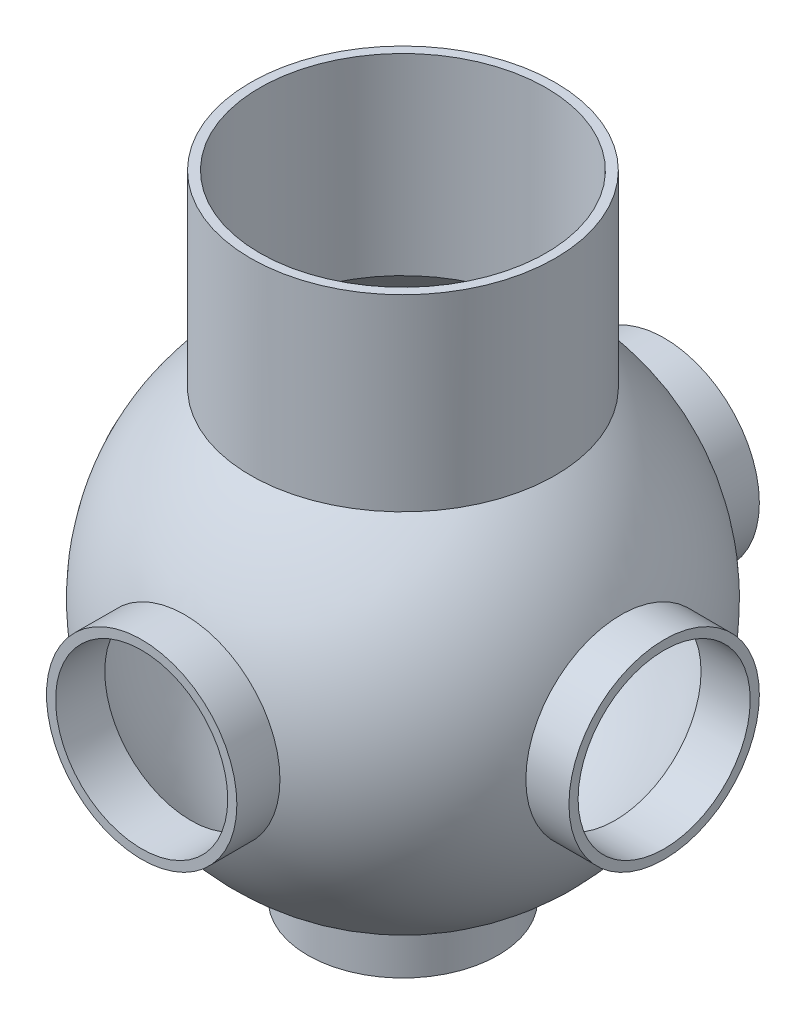
ISO-10303-21;
HEADER;
FILE_DESCRIPTION(('STEP AP214'),'2;1');
FILE_NAME('part.step','',(''),(''),'','','');
FILE_SCHEMA(('AUTOMOTIVE_DESIGN { 1 0 10303 214 1 1 1 1 }'));
ENDSEC;
DATA;
#1=APPLICATION_CONTEXT('core data for automotive mechanical design processes');
#2=APPLICATION_PROTOCOL_DEFINITION('international standard','automotive_design',2000,#1);
#3=PRODUCT_CONTEXT('',#1,'mechanical');
#4=PRODUCT('Part','Part','',(#3));
#5=PRODUCT_RELATED_PRODUCT_CATEGORY('part','',(#4));
#6=PRODUCT_DEFINITION_FORMATION('','',#4);
#7=PRODUCT_DEFINITION_CONTEXT('part definition',#1,'design');
#8=PRODUCT_DEFINITION('design','',#6,#7);
#9=PRODUCT_DEFINITION_SHAPE('','',#8);
#10=(LENGTH_UNIT() NAMED_UNIT(*) SI_UNIT(.MILLI.,.METRE.));
#11=(NAMED_UNIT(*) PLANE_ANGLE_UNIT() SI_UNIT($,.RADIAN.));
#12=(NAMED_UNIT(*) SI_UNIT($,.STERADIAN.) SOLID_ANGLE_UNIT());
#13=UNCERTAINTY_MEASURE_WITH_UNIT(LENGTH_MEASURE(1.E-05),#10,'distance_accuracy_value','');
#14=(GEOMETRIC_REPRESENTATION_CONTEXT(3) GLOBAL_UNCERTAINTY_ASSIGNED_CONTEXT((#13)) GLOBAL_UNIT_ASSIGNED_CONTEXT((#10,
#11,#12)) REPRESENTATION_CONTEXT('',''));
#15=CARTESIAN_POINT('',(0.,0.,0.));
#16=DIRECTION('',(0.,0.,1.));
#17=DIRECTION('',(1.,0.,0.));
#18=AXIS2_PLACEMENT_3D('',#15,#16,#17);
#19=CARTESIAN_POINT('',(0.,123.698,0.));
#20=DIRECTION('',(0.,-1.,0.));
#21=DIRECTION('',(0.,0.,-1.));
#22=AXIS2_PLACEMENT_3D('',#19,#20,#21);
#23=CYLINDRICAL_SURFACE('',#22,47.752);
#24=CARTESIAN_POINT('',(0.,123.698,0.));
#25=DIRECTION('',(0.,1.,0.));
#26=DIRECTION('',(0.,0.,1.));
#27=AXIS2_PLACEMENT_3D('',#24,#25,#26);
#28=CIRCLE('',#27,47.752);
#29=CARTESIAN_POINT('',(0.,123.698,47.752));
#30=VERTEX_POINT('',#29);
#31=EDGE_CURVE('E68',#30,#30,#28,.T.);
#32=ORIENTED_EDGE('',*,*,#31,.T.);
#33=EDGE_LOOP('',(#32));
#34=FACE_BOUND('',#33,.T.);
#35=CARTESIAN_POINT('',(0.,59.5445835068144,0.));
#36=DIRECTION('',(0.,-1.,0.));
#37=DIRECTION('',(0.,0.,-1.));
#38=AXIS2_PLACEMENT_3D('',#35,#36,#37);
#39=CIRCLE('',#38,47.752);
#40=CARTESIAN_POINT('',(0.,59.5445835068144,-47.752));
#41=VERTEX_POINT('',#40);
#42=EDGE_CURVE('E144',#41,#41,#39,.T.);
#43=ORIENTED_EDGE('',*,*,#42,.T.);
#44=EDGE_LOOP('',(#43));
#45=FACE_BOUND('',#44,.T.);
#46=ADVANCED_FACE('F30',(#34,#45),#23,.F.);
#47=CARTESIAN_POINT('',(0.,-87.122,0.));
#48=DIRECTION('',(0.,1.,0.));
#49=DIRECTION('',(0.,0.,1.));
#50=AXIS2_PLACEMENT_3D('',#47,#48,#49);
#51=CYLINDRICAL_SURFACE('',#50,28.702);
#52=CARTESIAN_POINT('',(0.,-87.122,0.));
#53=DIRECTION('',(0.,1.,0.));
#54=DIRECTION('',(0.,0.,1.));
#55=AXIS2_PLACEMENT_3D('',#52,#53,#54);
#56=CIRCLE('',#55,28.702);
#57=CARTESIAN_POINT('',(0.,-87.122,28.702));
#58=VERTEX_POINT('',#57);
#59=EDGE_CURVE('E75',#58,#58,#56,.T.);
#60=ORIENTED_EDGE('',*,*,#59,.F.);
#61=EDGE_LOOP('',(#60));
#62=FACE_BOUND('',#61,.T.);
#63=CARTESIAN_POINT('',(0.,-70.7248621419653,0.));
#64=DIRECTION('',(0.,1.,0.));
#65=DIRECTION('',(0.,0.,1.));
#66=AXIS2_PLACEMENT_3D('',#63,#64,#65);
#67=CIRCLE('',#66,28.702);
#68=CARTESIAN_POINT('',(0.,-70.7248621419653,28.702));
#69=VERTEX_POINT('',#68);
#70=EDGE_CURVE('E162',#69,#69,#67,.F.);
#71=ORIENTED_EDGE('',*,*,#70,.F.);
#72=EDGE_LOOP('',(#71));
#73=FACE_BOUND('',#72,.T.);
#74=ADVANCED_FACE('F109',(#62,#73),#51,.F.);
#75=CARTESIAN_POINT('',(0.,0.,-87.122));
#76=DIRECTION('',(0.,0.,1.));
#77=DIRECTION('',(1.,0.,0.));
#78=AXIS2_PLACEMENT_3D('',#75,#76,#77);
#79=CYLINDRICAL_SURFACE('',#78,28.702);
#80=CARTESIAN_POINT('',(0.,0.,-87.122));
#81=DIRECTION('',(0.,0.,1.));
#82=DIRECTION('',(1.,0.,0.));
#83=AXIS2_PLACEMENT_3D('',#80,#81,#82);
#84=CIRCLE('',#83,28.702);
#85=CARTESIAN_POINT('',(28.702,0.,-87.122));
#86=VERTEX_POINT('',#85);
#87=EDGE_CURVE('E80',#86,#86,#84,.T.);
#88=ORIENTED_EDGE('',*,*,#87,.F.);
#89=EDGE_LOOP('',(#88));
#90=FACE_BOUND('',#89,.T.);
#91=CARTESIAN_POINT('',(0.,0.,-70.7248621419653));
#92=DIRECTION('',(0.,0.,1.));
#93=DIRECTION('',(1.,0.,0.));
#94=AXIS2_PLACEMENT_3D('',#91,#92,#93);
#95=CIRCLE('',#94,28.702);
#96=CARTESIAN_POINT('',(28.702,0.,-70.7248621419653));
#97=VERTEX_POINT('',#96);
#98=EDGE_CURVE('E148',#97,#97,#95,.F.);
#99=ORIENTED_EDGE('',*,*,#98,.F.);
#100=EDGE_LOOP('',(#99));
#101=FACE_BOUND('',#100,.T.);
#102=ADVANCED_FACE('F113',(#90,#101),#79,.F.);
#103=CARTESIAN_POINT('',(0.,0.,87.122));
#104=DIRECTION('',(0.,0.,1.));
#105=DIRECTION('',(1.,0.,0.));
#106=AXIS2_PLACEMENT_3D('',#103,#104,#105);
#107=CIRCLE('',#106,28.702);
#108=CARTESIAN_POINT('',(28.702,0.,87.122));
#109=VERTEX_POINT('',#108);
#110=EDGE_CURVE('E175',#109,#109,#107,.T.);
#111=ORIENTED_EDGE('',*,*,#110,.T.);
#112=EDGE_LOOP('',(#111));
#113=FACE_BOUND('',#112,.T.);
#114=CARTESIAN_POINT('',(0.,0.,70.7248621419653));
#115=DIRECTION('',(0.,0.,-1.));
#116=DIRECTION('',(-1.,0.,0.));
#117=AXIS2_PLACEMENT_3D('',#114,#115,#116);
#118=CIRCLE('',#117,28.702);
#119=CARTESIAN_POINT('',(-28.702,0.,70.7248621419653));
#120=VERTEX_POINT('',#119);
#121=EDGE_CURVE('E159',#120,#120,#118,.F.);
#122=ORIENTED_EDGE('',*,*,#121,.F.);
#123=EDGE_LOOP('',(#122));
#124=FACE_BOUND('',#123,.T.);
#125=ADVANCED_FACE('F120',(#113,#124),#79,.F.);
#126=CARTESIAN_POINT('',(87.122,0.,0.));
#127=DIRECTION('',(-1.,0.,0.));
#128=DIRECTION('',(0.,0.,1.));
#129=AXIS2_PLACEMENT_3D('',#126,#127,#128);
#130=CYLINDRICAL_SURFACE('',#129,28.702);
#131=CARTESIAN_POINT('',(87.122,0.,0.));
#132=DIRECTION('',(1.,0.,0.));
#133=DIRECTION('',(0.,0.,-1.));
#134=AXIS2_PLACEMENT_3D('',#131,#132,#133);
#135=CIRCLE('',#134,28.702);
#136=CARTESIAN_POINT('',(87.122,0.,-28.702));
#137=VERTEX_POINT('',#136);
#138=EDGE_CURVE('E172',#137,#137,#135,.T.);
#139=ORIENTED_EDGE('',*,*,#138,.T.);
#140=EDGE_LOOP('',(#139));
#141=FACE_BOUND('',#140,.T.);
#142=CARTESIAN_POINT('',(70.7248621419653,0.,0.));
#143=DIRECTION('',(-1.,0.,0.));
#144=DIRECTION('',(0.,0.,1.));
#145=AXIS2_PLACEMENT_3D('',#142,#143,#144);
#146=CIRCLE('',#145,28.702);
#147=CARTESIAN_POINT('',(70.7248621419653,0.,28.702));
#148=VERTEX_POINT('',#147);
#149=EDGE_CURVE('E155',#148,#148,#146,.T.);
#150=ORIENTED_EDGE('',*,*,#149,.T.);
#151=EDGE_LOOP('',(#150));
#152=FACE_BOUND('',#151,.T.);
#153=ADVANCED_FACE('F122',(#141,#152),#130,.F.);
#154=CARTESIAN_POINT('',(-83.82,0.,0.));
#155=DIRECTION('',(1.,0.,0.));
#156=DIRECTION('',(0.,0.,-1.));
#157=AXIS2_PLACEMENT_3D('',#154,#155,#156);
#158=CYLINDRICAL_SURFACE('',#157,17.399);
#159=CARTESIAN_POINT('',(-83.82,0.,0.));
#160=DIRECTION('',(1.,0.,0.));
#161=DIRECTION('',(0.,0.,-1.));
#162=AXIS2_PLACEMENT_3D('',#159,#160,#161);
#163=CIRCLE('',#162,17.399);
#164=CARTESIAN_POINT('',(-83.82,0.,-17.399));
#165=VERTEX_POINT('',#164);
#166=EDGE_CURVE('E165',#165,#165,#163,.T.);
#167=ORIENTED_EDGE('',*,*,#166,.F.);
#168=EDGE_LOOP('',(#167));
#169=FACE_BOUND('',#168,.T.);
#170=CARTESIAN_POINT('',(-74.3174658340824,0.,0.));
#171=DIRECTION('',(1.,0.,0.));
#172=DIRECTION('',(0.,0.,-1.));
#173=AXIS2_PLACEMENT_3D('',#170,#171,#172);
#174=CIRCLE('',#173,17.399);
#175=CARTESIAN_POINT('',(-74.3174658340824,0.,-17.399));
#176=VERTEX_POINT('',#175);
#177=EDGE_CURVE('E34',#176,#176,#174,.F.);
#178=ORIENTED_EDGE('',*,*,#177,.F.);
#179=EDGE_LOOP('',(#178));
#180=FACE_BOUND('',#179,.T.);
#181=ADVANCED_FACE('F125',(#169,#180),#158,.F.);
#182=CARTESIAN_POINT('',(87.122,0.,0.));
#183=DIRECTION('',(1.,0.,0.));
#184=DIRECTION('',(0.,0.,-1.));
#185=AXIS2_PLACEMENT_3D('',#182,#183,#184);
#186=PLANE('',#185);
#187=CARTESIAN_POINT('',(87.122,0.,0.));
#188=DIRECTION('',(1.,0.,0.));
#189=DIRECTION('',(0.,0.,-1.));
#190=AXIS2_PLACEMENT_3D('',#187,#188,#189);
#191=CIRCLE('',#190,31.75);
#192=CARTESIAN_POINT('',(87.122,0.,-31.75));
#193=VERTEX_POINT('',#192);
#194=EDGE_CURVE('E52',#193,#193,#191,.T.);
#195=ORIENTED_EDGE('',*,*,#194,.T.);
#196=EDGE_LOOP('',(#195));
#197=FACE_BOUND('',#196,.T.);
#198=ORIENTED_EDGE('',*,*,#138,.F.);
#199=EDGE_LOOP('',(#198));
#200=FACE_BOUND('',#199,.T.);
#201=ADVANCED_FACE('F129',(#197,#200),#186,.T.);
#202=CARTESIAN_POINT('',(0.,123.698,0.));
#203=DIRECTION('',(0.,1.,0.));
#204=DIRECTION('',(0.,0.,1.));
#205=AXIS2_PLACEMENT_3D('',#202,#203,#204);
#206=PLANE('',#205);
#207=CARTESIAN_POINT('',(0.,123.698,0.));
#208=DIRECTION('',(0.,1.,0.));
#209=DIRECTION('',(0.,0.,1.));
#210=AXIS2_PLACEMENT_3D('',#207,#208,#209);
#211=CIRCLE('',#210,50.8);
#212=CARTESIAN_POINT('',(0.,123.698,50.8));
#213=VERTEX_POINT('',#212);
#214=EDGE_CURVE('E43',#213,#213,#211,.T.);
#215=ORIENTED_EDGE('',*,*,#214,.T.);
#216=EDGE_LOOP('',(#215));
#217=FACE_BOUND('',#216,.T.);
#218=ORIENTED_EDGE('',*,*,#31,.F.);
#219=EDGE_LOOP('',(#218));
#220=FACE_BOUND('',#219,.T.);
#221=ADVANCED_FACE('F103',(#217,#220),#206,.T.);
#222=CARTESIAN_POINT('',(0.,123.698,0.));
#223=DIRECTION('',(0.,-1.,0.));
#224=DIRECTION('',(0.,0.,-1.));
#225=AXIS2_PLACEMENT_3D('',#222,#223,#224);
#226=CYLINDRICAL_SURFACE('',#225,50.8);
#227=ORIENTED_EDGE('',*,*,#214,.F.);
#228=EDGE_LOOP('',(#227));
#229=FACE_BOUND('',#228,.T.);
#230=CARTESIAN_POINT('',(0.,60.9897583615479,0.));
#231=DIRECTION('',(0.,-1.,0.));
#232=DIRECTION('',(0.,0.,-1.));
#233=AXIS2_PLACEMENT_3D('',#230,#231,#232);
#234=CIRCLE('',#233,50.8);
#235=CARTESIAN_POINT('',(0.,60.9897583615479,-50.8));
#236=VERTEX_POINT('',#235);
#237=EDGE_CURVE('E10',#236,#236,#234,.T.);
#238=ORIENTED_EDGE('',*,*,#237,.F.);
#239=EDGE_LOOP('',(#238));
#240=FACE_BOUND('',#239,.T.);
#241=ADVANCED_FACE('F32',(#229,#240),#226,.T.);
#242=CARTESIAN_POINT('',(0.,0.,0.));
#243=DIRECTION('',(1.,0.,0.));
#244=DIRECTION('',(0.,0.,1.));
#245=AXIS2_PLACEMENT_3D('',#242,#243,#244);
#246=SPHERICAL_SURFACE('',#245,79.375);
#247=CARTESIAN_POINT('',(72.748389157424,0.,0.));
#248=DIRECTION('',(-1.,0.,0.));
#249=DIRECTION('',(0.,0.,1.));
#250=AXIS2_PLACEMENT_3D('',#247,#248,#249);
#251=CIRCLE('',#250,31.75);
#252=CARTESIAN_POINT('',(72.748389157424,0.,31.75));
#253=VERTEX_POINT('',#252);
#254=EDGE_CURVE('E38',#253,#253,#251,.T.);
#255=ORIENTED_EDGE('',*,*,#254,.T.);
#256=EDGE_LOOP('',(#255));
#257=FACE_BOUND('',#256,.T.);
#258=CARTESIAN_POINT('',(-77.0550979818987,0.,0.));
#259=DIRECTION('',(1.,0.,0.));
#260=DIRECTION('',(0.,0.,-1.));
#261=AXIS2_PLACEMENT_3D('',#258,#259,#260);
#262=CIRCLE('',#261,19.05);
#263=CARTESIAN_POINT('',(-77.0550979818987,0.,-19.05));
#264=VERTEX_POINT('',#263);
#265=EDGE_CURVE('E65',#264,#264,#262,.F.);
#266=ORIENTED_EDGE('',*,*,#265,.F.);
#267=EDGE_LOOP('',(#266));
#268=FACE_BOUND('',#267,.T.);
#269=CARTESIAN_POINT('',(0.,0.,72.748389157424));
#270=DIRECTION('',(0.,0.,-1.));
#271=DIRECTION('',(-1.,0.,0.));
#272=AXIS2_PLACEMENT_3D('',#269,#270,#271);
#273=CIRCLE('',#272,31.75);
#274=CARTESIAN_POINT('',(-31.75,0.,72.748389157424));
#275=VERTEX_POINT('',#274);
#276=EDGE_CURVE('E67',#275,#275,#273,.F.);
#277=ORIENTED_EDGE('',*,*,#276,.F.);
#278=EDGE_LOOP('',(#277));
#279=FACE_BOUND('',#278,.T.);
#280=CARTESIAN_POINT('',(0.,-72.748389157424,0.));
#281=DIRECTION('',(0.,1.,0.));
#282=DIRECTION('',(0.,0.,1.));
#283=AXIS2_PLACEMENT_3D('',#280,#281,#282);
#284=CIRCLE('',#283,31.75);
#285=CARTESIAN_POINT('',(0.,-72.748389157424,31.75));
#286=VERTEX_POINT('',#285);
#287=EDGE_CURVE('E72',#286,#286,#284,.F.);
#288=ORIENTED_EDGE('',*,*,#287,.F.);
#289=EDGE_LOOP('',(#288));
#290=FACE_BOUND('',#289,.T.);
#291=CARTESIAN_POINT('',(0.,0.,-72.748389157424));
#292=DIRECTION('',(0.,0.,1.));
#293=DIRECTION('',(1.,0.,0.));
#294=AXIS2_PLACEMENT_3D('',#291,#292,#293);
#295=CIRCLE('',#294,31.75);
#296=CARTESIAN_POINT('',(31.75,0.,-72.748389157424));
#297=VERTEX_POINT('',#296);
#298=EDGE_CURVE('E47',#297,#297,#295,.F.);
#299=ORIENTED_EDGE('',*,*,#298,.F.);
#300=EDGE_LOOP('',(#299));
#301=FACE_BOUND('',#300,.T.);
#302=ORIENTED_EDGE('',*,*,#237,.T.);
#303=EDGE_LOOP('',(#302));
#304=FACE_BOUND('',#303,.T.);
#305=ADVANCED_FACE('F91',(#257,#268,#279,#290,#301,#304),#246,.T.);
#306=CARTESIAN_POINT('',(87.122,0.,0.));
#307=DIRECTION('',(-1.,0.,0.));
#308=DIRECTION('',(0.,0.,1.));
#309=AXIS2_PLACEMENT_3D('',#306,#307,#308);
#310=CYLINDRICAL_SURFACE('',#309,31.75);
#311=ORIENTED_EDGE('',*,*,#194,.F.);
#312=EDGE_LOOP('',(#311));
#313=FACE_BOUND('',#312,.T.);
#314=ORIENTED_EDGE('',*,*,#254,.F.);
#315=EDGE_LOOP('',(#314));
#316=FACE_BOUND('',#315,.T.);
#317=ADVANCED_FACE('F93',(#313,#316),#310,.T.);
#318=CARTESIAN_POINT('',(0.,0.,87.122));
#319=DIRECTION('',(0.,0.,1.));
#320=DIRECTION('',(1.,0.,0.));
#321=AXIS2_PLACEMENT_3D('',#318,#319,#320);
#322=PLANE('',#321);
#323=ORIENTED_EDGE('',*,*,#110,.F.);
#324=EDGE_LOOP('',(#323));
#325=FACE_BOUND('',#324,.T.);
#326=CARTESIAN_POINT('',(0.,0.,87.122));
#327=DIRECTION('',(0.,0.,1.));
#328=DIRECTION('',(1.,0.,0.));
#329=AXIS2_PLACEMENT_3D('',#326,#327,#328);
#330=CIRCLE('',#329,31.75);
#331=CARTESIAN_POINT('',(31.75,0.,87.122));
#332=VERTEX_POINT('',#331);
#333=EDGE_CURVE('E55',#332,#332,#330,.T.);
#334=ORIENTED_EDGE('',*,*,#333,.T.);
#335=EDGE_LOOP('',(#334));
#336=FACE_BOUND('',#335,.T.);
#337=ADVANCED_FACE('F100',(#325,#336),#322,.T.);
#338=CARTESIAN_POINT('',(0.,0.,-87.122));
#339=DIRECTION('',(0.,0.,1.));
#340=DIRECTION('',(1.,0.,0.));
#341=AXIS2_PLACEMENT_3D('',#338,#339,#340);
#342=CYLINDRICAL_SURFACE('',#341,31.75);
#343=ORIENTED_EDGE('',*,*,#333,.F.);
#344=EDGE_LOOP('',(#343));
#345=FACE_BOUND('',#344,.T.);
#346=ORIENTED_EDGE('',*,*,#276,.T.);
#347=EDGE_LOOP('',(#346));
#348=FACE_BOUND('',#347,.T.);
#349=ADVANCED_FACE('F190',(#345,#348),#342,.T.);
#350=CARTESIAN_POINT('',(0.,-87.122,0.));
#351=DIRECTION('',(0.,1.,0.));
#352=DIRECTION('',(0.,0.,1.));
#353=AXIS2_PLACEMENT_3D('',#350,#351,#352);
#354=PLANE('',#353);
#355=ORIENTED_EDGE('',*,*,#59,.T.);
#356=EDGE_LOOP('',(#355));
#357=FACE_BOUND('',#356,.T.);
#358=CARTESIAN_POINT('',(0.,-87.122,0.));
#359=DIRECTION('',(0.,1.,0.));
#360=DIRECTION('',(0.,0.,1.));
#361=AXIS2_PLACEMENT_3D('',#358,#359,#360);
#362=CIRCLE('',#361,31.75);
#363=CARTESIAN_POINT('',(0.,-87.122,31.75));
#364=VERTEX_POINT('',#363);
#365=EDGE_CURVE('E61',#364,#364,#362,.T.);
#366=ORIENTED_EDGE('',*,*,#365,.F.);
#367=EDGE_LOOP('',(#366));
#368=FACE_BOUND('',#367,.T.);
#369=ADVANCED_FACE('F197',(#357,#368),#354,.F.);
#370=CARTESIAN_POINT('',(0.,-87.122,0.));
#371=DIRECTION('',(0.,1.,0.));
#372=DIRECTION('',(0.,0.,1.));
#373=AXIS2_PLACEMENT_3D('',#370,#371,#372);
#374=CYLINDRICAL_SURFACE('',#373,31.75);
#375=ORIENTED_EDGE('',*,*,#365,.T.);
#376=EDGE_LOOP('',(#375));
#377=FACE_BOUND('',#376,.T.);
#378=ORIENTED_EDGE('',*,*,#287,.T.);
#379=EDGE_LOOP('',(#378));
#380=FACE_BOUND('',#379,.T.);
#381=ADVANCED_FACE('F184',(#377,#380),#374,.T.);
#382=CARTESIAN_POINT('',(0.,0.,-87.122));
#383=DIRECTION('',(0.,0.,1.));
#384=DIRECTION('',(1.,0.,0.));
#385=AXIS2_PLACEMENT_3D('',#382,#383,#384);
#386=PLANE('',#385);
#387=ORIENTED_EDGE('',*,*,#87,.T.);
#388=EDGE_LOOP('',(#387));
#389=FACE_BOUND('',#388,.T.);
#390=CARTESIAN_POINT('',(0.,0.,-87.122));
#391=DIRECTION('',(0.,0.,1.));
#392=DIRECTION('',(1.,0.,0.));
#393=AXIS2_PLACEMENT_3D('',#390,#391,#392);
#394=CIRCLE('',#393,31.75);
#395=CARTESIAN_POINT('',(31.75,0.,-87.122));
#396=VERTEX_POINT('',#395);
#397=EDGE_CURVE('E58',#396,#396,#394,.T.);
#398=ORIENTED_EDGE('',*,*,#397,.F.);
#399=EDGE_LOOP('',(#398));
#400=FACE_BOUND('',#399,.T.);
#401=ADVANCED_FACE('F180',(#389,#400),#386,.F.);
#402=ORIENTED_EDGE('',*,*,#397,.T.);
#403=EDGE_LOOP('',(#402));
#404=FACE_BOUND('',#403,.T.);
#405=ORIENTED_EDGE('',*,*,#298,.T.);
#406=EDGE_LOOP('',(#405));
#407=FACE_BOUND('',#406,.T.);
#408=ADVANCED_FACE('F89',(#404,#407),#342,.T.);
#409=CARTESIAN_POINT('',(-83.82,0.,0.));
#410=DIRECTION('',(1.,0.,0.));
#411=DIRECTION('',(0.,0.,-1.));
#412=AXIS2_PLACEMENT_3D('',#409,#410,#411);
#413=PLANE('',#412);
#414=ORIENTED_EDGE('',*,*,#166,.T.);
#415=EDGE_LOOP('',(#414));
#416=FACE_BOUND('',#415,.T.);
#417=CARTESIAN_POINT('',(-83.82,0.,0.));
#418=DIRECTION('',(1.,0.,0.));
#419=DIRECTION('',(0.,0.,-1.));
#420=AXIS2_PLACEMENT_3D('',#417,#418,#419);
#421=CIRCLE('',#420,19.05);
#422=CARTESIAN_POINT('',(-83.82,0.,-19.05));
#423=VERTEX_POINT('',#422);
#424=EDGE_CURVE('E49',#423,#423,#421,.T.);
#425=ORIENTED_EDGE('',*,*,#424,.F.);
#426=EDGE_LOOP('',(#425));
#427=FACE_BOUND('',#426,.T.);
#428=ADVANCED_FACE('F138',(#416,#427),#413,.F.);
#429=CARTESIAN_POINT('',(-83.82,0.,0.));
#430=DIRECTION('',(1.,0.,0.));
#431=DIRECTION('',(0.,0.,-1.));
#432=AXIS2_PLACEMENT_3D('',#429,#430,#431);
#433=CYLINDRICAL_SURFACE('',#432,19.05);
#434=ORIENTED_EDGE('',*,*,#424,.T.);
#435=EDGE_LOOP('',(#434));
#436=FACE_BOUND('',#435,.T.);
#437=ORIENTED_EDGE('',*,*,#265,.T.);
#438=EDGE_LOOP('',(#437));
#439=FACE_BOUND('',#438,.T.);
#440=ADVANCED_FACE('F133',(#436,#439),#433,.T.);
#441=CARTESIAN_POINT('',(0.,0.,0.));
#442=DIRECTION('',(0.,0.,-1.));
#443=DIRECTION('',(-1.,0.,0.));
#444=AXIS2_PLACEMENT_3D('',#441,#442,#443);
#445=SPHERICAL_SURFACE('',#444,76.327);
#446=ORIENTED_EDGE('',*,*,#42,.F.);
#447=EDGE_LOOP('',(#446));
#448=FACE_BOUND('',#447,.T.);
#449=ORIENTED_EDGE('',*,*,#98,.T.);
#450=EDGE_LOOP('',(#449));
#451=FACE_BOUND('',#450,.T.);
#452=ORIENTED_EDGE('',*,*,#177,.T.);
#453=EDGE_LOOP('',(#452));
#454=FACE_BOUND('',#453,.T.);
#455=ORIENTED_EDGE('',*,*,#149,.F.);
#456=EDGE_LOOP('',(#455));
#457=FACE_BOUND('',#456,.T.);
#458=ORIENTED_EDGE('',*,*,#121,.T.);
#459=EDGE_LOOP('',(#458));
#460=FACE_BOUND('',#459,.T.);
#461=ORIENTED_EDGE('',*,*,#70,.T.);
#462=EDGE_LOOP('',(#461));
#463=FACE_BOUND('',#462,.T.);
#464=ADVANCED_FACE('F131',(#448,#451,#454,#457,#460,#463),#445,.F.);
#465=CLOSED_SHELL('',(#46,#74,#102,#125,#153,#181,#201,#221,#241,#305,#317,#337,#349,#369,#381,
#401,#408,#428,#440,#464));
#466=MANIFOLD_SOLID_BREP('B2',#465);
#467=ADVANCED_BREP_SHAPE_REPRESENTATION('',(#18,#466),#14);
#468=SHAPE_DEFINITION_REPRESENTATION(#9,#467);
ENDSEC;
END-ISO-10303-21;
